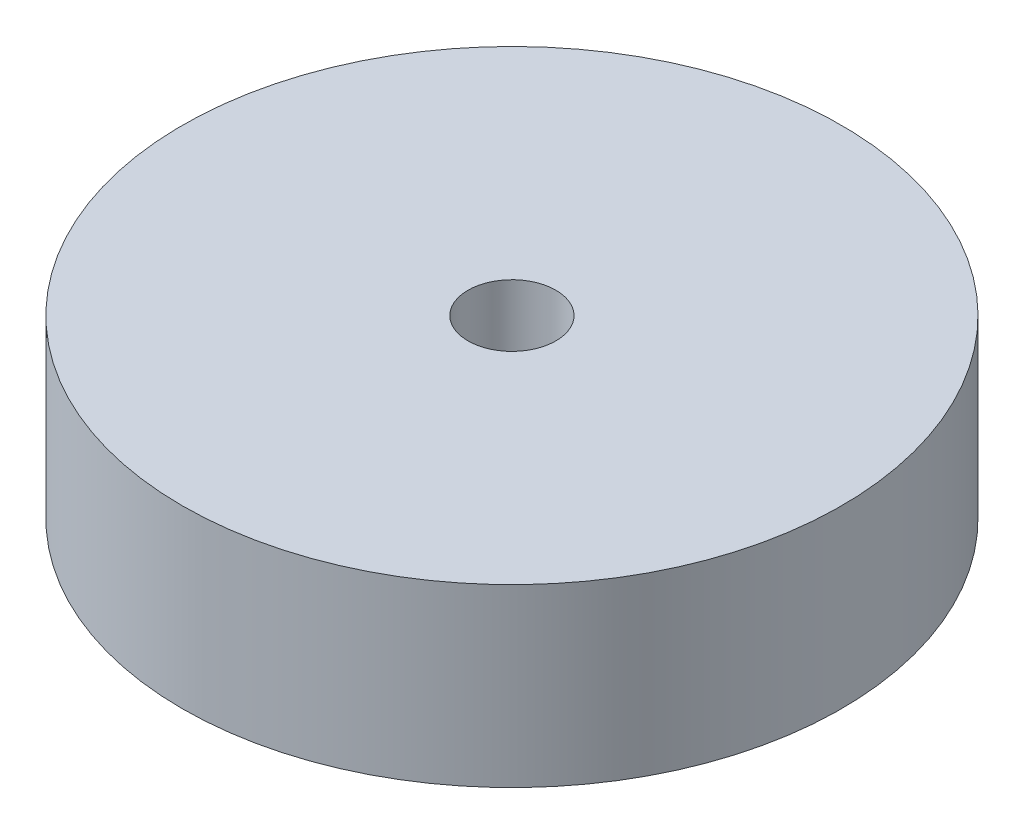
ISO-10303-21;
HEADER;
FILE_DESCRIPTION(('STEP AP214'),'2;1');
FILE_NAME('part.step','',(''),(''),'','','');
FILE_SCHEMA(('AUTOMOTIVE_DESIGN { 1 0 10303 214 1 1 1 1 }'));
ENDSEC;
DATA;
#1=APPLICATION_CONTEXT('core data for automotive mechanical design processes');
#2=APPLICATION_PROTOCOL_DEFINITION('international standard','automotive_design',2000,#1);
#3=PRODUCT_CONTEXT('',#1,'mechanical');
#4=PRODUCT('Part','Part','',(#3));
#5=PRODUCT_RELATED_PRODUCT_CATEGORY('part','',(#4));
#6=PRODUCT_DEFINITION_FORMATION('','',#4);
#7=PRODUCT_DEFINITION_CONTEXT('part definition',#1,'design');
#8=PRODUCT_DEFINITION('design','',#6,#7);
#9=PRODUCT_DEFINITION_SHAPE('','',#8);
#10=(LENGTH_UNIT() NAMED_UNIT(*) SI_UNIT(.MILLI.,.METRE.));
#11=(NAMED_UNIT(*) PLANE_ANGLE_UNIT() SI_UNIT($,.RADIAN.));
#12=(NAMED_UNIT(*) SI_UNIT($,.STERADIAN.) SOLID_ANGLE_UNIT());
#13=UNCERTAINTY_MEASURE_WITH_UNIT(LENGTH_MEASURE(1.E-05),#10,'distance_accuracy_value','');
#14=(GEOMETRIC_REPRESENTATION_CONTEXT(3) GLOBAL_UNCERTAINTY_ASSIGNED_CONTEXT((#13)) GLOBAL_UNIT_ASSIGNED_CONTEXT((#10,
#11,#12)) REPRESENTATION_CONTEXT('',''));
#15=CARTESIAN_POINT('',(0.,0.,0.));
#16=DIRECTION('',(0.,0.,1.));
#17=DIRECTION('',(1.,0.,0.));
#18=AXIS2_PLACEMENT_3D('',#15,#16,#17);
#19=CARTESIAN_POINT('',(0.,25.4,0.));
#20=DIRECTION('',(0.,-1.,0.));
#21=DIRECTION('',(0.,0.,-1.));
#22=AXIS2_PLACEMENT_3D('',#19,#20,#21);
#23=CYLINDRICAL_SURFACE('',#22,47.625);
#24=CARTESIAN_POINT('',(0.,25.4,0.));
#25=DIRECTION('',(0.,1.,0.));
#26=DIRECTION('',(0.,0.,1.));
#27=AXIS2_PLACEMENT_3D('',#24,#25,#26);
#28=CIRCLE('',#27,47.625);
#29=CARTESIAN_POINT('',(0.,25.4,47.625));
#30=VERTEX_POINT('',#29);
#31=EDGE_CURVE('E10',#30,#30,#28,.T.);
#32=ORIENTED_EDGE('',*,*,#31,.F.);
#33=EDGE_LOOP('',(#32));
#34=FACE_BOUND('',#33,.T.);
#35=CARTESIAN_POINT('',(0.,0.,0.));
#36=DIRECTION('',(0.,1.,0.));
#37=DIRECTION('',(0.,0.,1.));
#38=AXIS2_PLACEMENT_3D('',#35,#36,#37);
#39=CIRCLE('',#38,47.625);
#40=CARTESIAN_POINT('',(0.,0.,47.625));
#41=VERTEX_POINT('',#40);
#42=EDGE_CURVE('E34',#41,#41,#39,.T.);
#43=ORIENTED_EDGE('',*,*,#42,.T.);
#44=EDGE_LOOP('',(#43));
#45=FACE_BOUND('',#44,.T.);
#46=ADVANCED_FACE('F31',(#34,#45),#23,.T.);
#47=CARTESIAN_POINT('',(0.,25.4,0.));
#48=DIRECTION('',(0.,1.,0.));
#49=DIRECTION('',(0.,0.,1.));
#50=AXIS2_PLACEMENT_3D('',#47,#48,#49);
#51=PLANE('',#50);
#52=CARTESIAN_POINT('',(0.,25.4,0.));
#53=DIRECTION('',(0.,-1.,0.));
#54=DIRECTION('',(0.,0.,-1.));
#55=AXIS2_PLACEMENT_3D('',#52,#53,#54);
#56=CIRCLE('',#55,6.35);
#57=CARTESIAN_POINT('',(0.,25.4,-6.35));
#58=VERTEX_POINT('',#57);
#59=EDGE_CURVE('E41',#58,#58,#56,.T.);
#60=ORIENTED_EDGE('',*,*,#59,.T.);
#61=EDGE_LOOP('',(#60));
#62=FACE_BOUND('',#61,.T.);
#63=ORIENTED_EDGE('',*,*,#31,.T.);
#64=EDGE_LOOP('',(#63));
#65=FACE_BOUND('',#64,.T.);
#66=ADVANCED_FACE('F49',(#62,#65),#51,.T.);
#67=CARTESIAN_POINT('',(0.,0.,0.));
#68=DIRECTION('',(0.,1.,0.));
#69=DIRECTION('',(0.,0.,1.));
#70=AXIS2_PLACEMENT_3D('',#67,#68,#69);
#71=PLANE('',#70);
#72=CARTESIAN_POINT('',(0.,0.,0.));
#73=DIRECTION('',(0.,-1.,0.));
#74=DIRECTION('',(0.,0.,-1.));
#75=AXIS2_PLACEMENT_3D('',#72,#73,#74);
#76=CIRCLE('',#75,6.35);
#77=CARTESIAN_POINT('',(0.,0.,-6.35));
#78=VERTEX_POINT('',#77);
#79=EDGE_CURVE('E43',#78,#78,#76,.T.);
#80=ORIENTED_EDGE('',*,*,#79,.F.);
#81=EDGE_LOOP('',(#80));
#82=FACE_BOUND('',#81,.T.);
#83=ORIENTED_EDGE('',*,*,#42,.F.);
#84=EDGE_LOOP('',(#83));
#85=FACE_BOUND('',#84,.T.);
#86=ADVANCED_FACE('F54',(#82,#85),#71,.F.);
#87=CARTESIAN_POINT('',(0.,25.4,0.));
#88=DIRECTION('',(0.,-1.,0.));
#89=DIRECTION('',(0.,0.,-1.));
#90=AXIS2_PLACEMENT_3D('',#87,#88,#89);
#91=CYLINDRICAL_SURFACE('',#90,6.35);
#92=ORIENTED_EDGE('',*,*,#59,.F.);
#93=EDGE_LOOP('',(#92));
#94=FACE_BOUND('',#93,.T.);
#95=ORIENTED_EDGE('',*,*,#79,.T.);
#96=EDGE_LOOP('',(#95));
#97=FACE_BOUND('',#96,.T.);
#98=ADVANCED_FACE('F51',(#94,#97),#91,.F.);
#99=CLOSED_SHELL('',(#46,#66,#86,#98));
#100=MANIFOLD_SOLID_BREP('B2',#99);
#101=ADVANCED_BREP_SHAPE_REPRESENTATION('',(#18,#100),#14);
#102=SHAPE_DEFINITION_REPRESENTATION(#9,#101);
ENDSEC;
END-ISO-10303-21;
